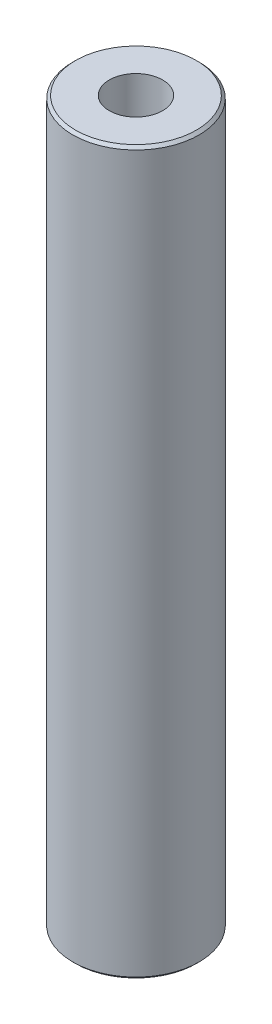
ISO-10303-21;
HEADER;
FILE_DESCRIPTION(('STEP AP214'),'2;1');
FILE_NAME('part.step','',(''),(''),'','','');
FILE_SCHEMA(('AUTOMOTIVE_DESIGN { 1 0 10303 214 1 1 1 1 }'));
ENDSEC;
DATA;
#1=APPLICATION_CONTEXT('core data for automotive mechanical design processes');
#2=APPLICATION_PROTOCOL_DEFINITION('international standard','automotive_design',2000,#1);
#3=PRODUCT_CONTEXT('',#1,'mechanical');
#4=PRODUCT('Part','Part','',(#3));
#5=PRODUCT_RELATED_PRODUCT_CATEGORY('part','',(#4));
#6=PRODUCT_DEFINITION_FORMATION('','',#4);
#7=PRODUCT_DEFINITION_CONTEXT('part definition',#1,'design');
#8=PRODUCT_DEFINITION('design','',#6,#7);
#9=PRODUCT_DEFINITION_SHAPE('','',#8);
#10=(LENGTH_UNIT() NAMED_UNIT(*) SI_UNIT(.MILLI.,.METRE.));
#11=(NAMED_UNIT(*) PLANE_ANGLE_UNIT() SI_UNIT($,.RADIAN.));
#12=(NAMED_UNIT(*) SI_UNIT($,.STERADIAN.) SOLID_ANGLE_UNIT());
#13=UNCERTAINTY_MEASURE_WITH_UNIT(LENGTH_MEASURE(1.E-05),#10,'distance_accuracy_value','');
#14=(GEOMETRIC_REPRESENTATION_CONTEXT(3) GLOBAL_UNCERTAINTY_ASSIGNED_CONTEXT((#13)) GLOBAL_UNIT_ASSIGNED_CONTEXT((#10,
#11,#12)) REPRESENTATION_CONTEXT('',''));
#15=CARTESIAN_POINT('',(0.,0.,0.));
#16=DIRECTION('',(0.,0.,1.));
#17=DIRECTION('',(1.,0.,0.));
#18=AXIS2_PLACEMENT_3D('',#15,#16,#17);
#19=CARTESIAN_POINT('',(0.,600.,0.));
#20=DIRECTION('',(0.,-1.,0.));
#21=DIRECTION('',(0.,0.,-1.));
#22=AXIS2_PLACEMENT_3D('',#19,#20,#21);
#23=CYLINDRICAL_SURFACE('',#22,52.5);
#24=CARTESIAN_POINT('',(0.,597.7162842597,0.));
#25=DIRECTION('',(0.,1.,0.));
#26=DIRECTION('',(0.,0.,1.));
#27=AXIS2_PLACEMENT_3D('',#24,#25,#26);
#28=CIRCLE('',#27,52.5);
#29=CARTESIAN_POINT('',(0.,597.7162842597,52.5));
#30=VERTEX_POINT('',#29);
#31=EDGE_CURVE('E50',#30,#30,#28,.F.);
#32=ORIENTED_EDGE('',*,*,#31,.T.);
#33=EDGE_LOOP('',(#32));
#34=FACE_BOUND('',#33,.T.);
#35=CARTESIAN_POINT('',(0.,2.28371574030029,0.));
#36=DIRECTION('',(0.,1.,0.));
#37=DIRECTION('',(0.,0.,1.));
#38=AXIS2_PLACEMENT_3D('',#35,#36,#37);
#39=CIRCLE('',#38,52.5);
#40=CARTESIAN_POINT('',(0.,2.28371574030029,52.5));
#41=VERTEX_POINT('',#40);
#42=EDGE_CURVE('E51',#41,#41,#39,.T.);
#43=ORIENTED_EDGE('',*,*,#42,.T.);
#44=EDGE_LOOP('',(#43));
#45=FACE_BOUND('',#44,.T.);
#46=ADVANCED_FACE('F39',(#34,#45),#23,.T.);
#47=CARTESIAN_POINT('',(0.,600.,0.));
#48=DIRECTION('',(0.,1.,0.));
#49=DIRECTION('',(0.,0.,1.));
#50=AXIS2_PLACEMENT_3D('',#47,#48,#49);
#51=PLANE('',#50);
#52=CARTESIAN_POINT('',(0.,600.,0.));
#53=DIRECTION('',(0.,1.,0.));
#54=DIRECTION('',(0.,0.,1.));
#55=AXIS2_PLACEMENT_3D('',#52,#53,#54);
#56=CIRCLE('',#55,50.2162842596997);
#57=CARTESIAN_POINT('',(0.,600.,50.2162842596997));
#58=VERTEX_POINT('',#57);
#59=EDGE_CURVE('E54',#58,#58,#56,.T.);
#60=ORIENTED_EDGE('',*,*,#59,.T.);
#61=EDGE_LOOP('',(#60));
#62=FACE_BOUND('',#61,.T.);
#63=CARTESIAN_POINT('',(0.,600.,0.));
#64=DIRECTION('',(0.,1.,0.));
#65=DIRECTION('',(0.,0.,1.));
#66=AXIS2_PLACEMENT_3D('',#63,#64,#65);
#67=CIRCLE('',#66,22.1851307883609);
#68=CARTESIAN_POINT('',(0.,600.,22.1851307883609));
#69=VERTEX_POINT('',#68);
#70=EDGE_CURVE('E58',#69,#69,#67,.T.);
#71=ORIENTED_EDGE('',*,*,#70,.F.);
#72=EDGE_LOOP('',(#71));
#73=FACE_BOUND('',#72,.T.);
#74=ADVANCED_FACE('F69',(#62,#73),#51,.T.);
#75=CARTESIAN_POINT('',(0.,0.,0.));
#76=DIRECTION('',(0.,1.,0.));
#77=DIRECTION('',(0.,0.,1.));
#78=AXIS2_PLACEMENT_3D('',#75,#76,#77);
#79=PLANE('',#78);
#80=CARTESIAN_POINT('',(0.,0.,0.));
#81=DIRECTION('',(0.,1.,0.));
#82=DIRECTION('',(0.,0.,1.));
#83=AXIS2_PLACEMENT_3D('',#80,#81,#82);
#84=CIRCLE('',#83,50.2162842596997);
#85=CARTESIAN_POINT('',(0.,0.,50.2162842596997));
#86=VERTEX_POINT('',#85);
#87=EDGE_CURVE('E10',#86,#86,#84,.F.);
#88=ORIENTED_EDGE('',*,*,#87,.T.);
#89=EDGE_LOOP('',(#88));
#90=FACE_BOUND('',#89,.T.);
#91=CARTESIAN_POINT('',(0.,0.,0.));
#92=DIRECTION('',(0.,1.,0.));
#93=DIRECTION('',(0.,0.,1.));
#94=AXIS2_PLACEMENT_3D('',#91,#92,#93);
#95=CIRCLE('',#94,22.1851307883609);
#96=CARTESIAN_POINT('',(0.,0.,22.1851307883609));
#97=VERTEX_POINT('',#96);
#98=EDGE_CURVE('E63',#97,#97,#95,.T.);
#99=ORIENTED_EDGE('',*,*,#98,.T.);
#100=EDGE_LOOP('',(#99));
#101=FACE_BOUND('',#100,.T.);
#102=ADVANCED_FACE('F75',(#90,#101),#79,.F.);
#103=CARTESIAN_POINT('',(0.,600.,0.));
#104=DIRECTION('',(0.,-1.,0.));
#105=DIRECTION('',(0.,0.,-1.));
#106=AXIS2_PLACEMENT_3D('',#103,#104,#105);
#107=CYLINDRICAL_SURFACE('',#106,22.1851307883609);
#108=ORIENTED_EDGE('',*,*,#70,.T.);
#109=EDGE_LOOP('',(#108));
#110=FACE_BOUND('',#109,.T.);
#111=ORIENTED_EDGE('',*,*,#98,.F.);
#112=EDGE_LOOP('',(#111));
#113=FACE_BOUND('',#112,.T.);
#114=ADVANCED_FACE('F70',(#110,#113),#107,.F.);
#115=CARTESIAN_POINT('',(0.,600.,0.));
#116=DIRECTION('',(0.,-1.,0.));
#117=DIRECTION('',(0.,0.,-1.));
#118=AXIS2_PLACEMENT_3D('',#115,#116,#117);
#119=CONICAL_SURFACE('',#118,50.2162842596997,0.78539816339745);
#120=ORIENTED_EDGE('',*,*,#31,.F.);
#121=EDGE_LOOP('',(#120));
#122=FACE_BOUND('',#121,.T.);
#123=ORIENTED_EDGE('',*,*,#59,.F.);
#124=EDGE_LOOP('',(#123));
#125=FACE_BOUND('',#124,.T.);
#126=ADVANCED_FACE('F81',(#122,#125),#119,.T.);
#127=CARTESIAN_POINT('',(0.,2.28371574030029,0.));
#128=DIRECTION('',(0.,1.,0.));
#129=DIRECTION('',(0.,0.,1.));
#130=AXIS2_PLACEMENT_3D('',#127,#128,#129);
#131=CONICAL_SURFACE('',#130,52.5,0.78539816339745);
#132=ORIENTED_EDGE('',*,*,#87,.F.);
#133=EDGE_LOOP('',(#132));
#134=FACE_BOUND('',#133,.T.);
#135=ORIENTED_EDGE('',*,*,#42,.F.);
#136=EDGE_LOOP('',(#135));
#137=FACE_BOUND('',#136,.T.);
#138=ADVANCED_FACE('F45',(#134,#137),#131,.T.);
#139=CLOSED_SHELL('',(#46,#74,#102,#114,#126,#138));
#140=MANIFOLD_SOLID_BREP('B2',#139);
#141=ADVANCED_BREP_SHAPE_REPRESENTATION('',(#18,#140),#14);
#142=SHAPE_DEFINITION_REPRESENTATION(#9,#141);
ENDSEC;
END-ISO-10303-21;
